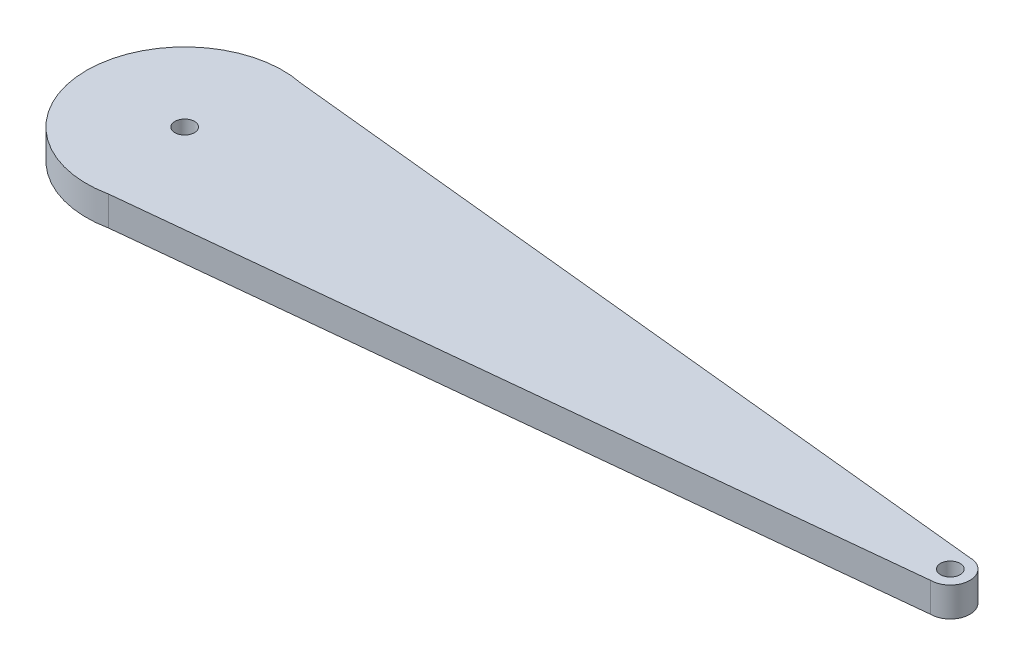
ISO-10303-21;
HEADER;
FILE_DESCRIPTION(('STEP AP214'),'2;1');
FILE_NAME('part.step','',(''),(''),'','','');
FILE_SCHEMA(('AUTOMOTIVE_DESIGN { 1 0 10303 214 1 1 1 1 }'));
ENDSEC;
DATA;
#1=APPLICATION_CONTEXT('core data for automotive mechanical design processes');
#2=APPLICATION_PROTOCOL_DEFINITION('international standard','automotive_design',2000,#1);
#3=PRODUCT_CONTEXT('',#1,'mechanical');
#4=PRODUCT('Part','Part','',(#3));
#5=PRODUCT_RELATED_PRODUCT_CATEGORY('part','',(#4));
#6=PRODUCT_DEFINITION_FORMATION('','',#4);
#7=PRODUCT_DEFINITION_CONTEXT('part definition',#1,'design');
#8=PRODUCT_DEFINITION('design','',#6,#7);
#9=PRODUCT_DEFINITION_SHAPE('','',#8);
#10=(LENGTH_UNIT() NAMED_UNIT(*) SI_UNIT(.MILLI.,.METRE.));
#11=(NAMED_UNIT(*) PLANE_ANGLE_UNIT() SI_UNIT($,.RADIAN.));
#12=(NAMED_UNIT(*) SI_UNIT($,.STERADIAN.) SOLID_ANGLE_UNIT());
#13=UNCERTAINTY_MEASURE_WITH_UNIT(LENGTH_MEASURE(1.E-05),#10,'distance_accuracy_value','');
#14=(GEOMETRIC_REPRESENTATION_CONTEXT(3) GLOBAL_UNCERTAINTY_ASSIGNED_CONTEXT((#13)) GLOBAL_UNIT_ASSIGNED_CONTEXT((#10,
#11,#12)) REPRESENTATION_CONTEXT('',''));
#15=CARTESIAN_POINT('',(0.,0.,0.));
#16=DIRECTION('',(0.,0.,1.));
#17=DIRECTION('',(1.,0.,0.));
#18=AXIS2_PLACEMENT_3D('',#15,#16,#17);
#19=CARTESIAN_POINT('',(0.,3.,0.));
#20=DIRECTION('',(0.,-1.,0.));
#21=DIRECTION('',(0.,0.,-1.));
#22=AXIS2_PLACEMENT_3D('',#19,#20,#21);
#23=PLANE('',#22);
#24=CARTESIAN_POINT('',(88.,3.,-10.));
#25=DIRECTION('',(0.,1.,0.));
#26=DIRECTION('',(0.,0.,1.));
#27=AXIS2_PLACEMENT_3D('',#24,#25,#26);
#28=CIRCLE('',#27,0.999999999999998);
#29=CARTESIAN_POINT('',(88.,3.,-9.));
#30=VERTEX_POINT('',#29);
#31=EDGE_CURVE('E136',#30,#30,#28,.T.);
#32=ORIENTED_EDGE('',*,*,#31,.F.);
#33=EDGE_LOOP('',(#32));
#34=FACE_BOUND('',#33,.T.);
#35=CARTESIAN_POINT('',(10.,3.,-10.));
#36=DIRECTION('',(0.,1.,0.));
#37=DIRECTION('',(0.,0.,1.));
#38=AXIS2_PLACEMENT_3D('',#35,#36,#37);
#39=CIRCLE('',#38,0.999999999999999);
#40=CARTESIAN_POINT('',(10.,3.,-9.));
#41=VERTEX_POINT('',#40);
#42=EDGE_CURVE('E173',#41,#41,#39,.T.);
#43=ORIENTED_EDGE('',*,*,#42,.F.);
#44=EDGE_LOOP('',(#43));
#45=FACE_BOUND('',#44,.T.);
#46=DIRECTION('',(0.994781438611053,0.,0.10202886549857));
#47=VECTOR('',#46,1.);
#48=CARTESIAN_POINT('',(2.13402732595966,3.,-20.8067664281067));
#49=LINE('',#48,#47);
#50=CARTESIAN_POINT('',(12.0299284320104,3.,-19.7918022121015));
#51=VERTEX_POINT('',#50);
#52=CARTESIAN_POINT('',(88.,3.,-12.));
#53=VERTEX_POINT('',#52);
#54=EDGE_CURVE('E117',#51,#53,#49,.T.);
#55=ORIENTED_EDGE('',*,*,#54,.F.);
#56=CARTESIAN_POINT('',(10.,3.,-10.));
#57=DIRECTION('',(0.,1.,0.));
#58=DIRECTION('',(0.,0.,1.));
#59=AXIS2_PLACEMENT_3D('',#56,#57,#58);
#60=CIRCLE('',#59,10.);
#61=CARTESIAN_POINT('',(12.0299284320104,3.,-0.208197787898494));
#62=VERTEX_POINT('',#61);
#63=EDGE_CURVE('E100',#51,#62,#60,.T.);
#64=ORIENTED_EDGE('',*,*,#63,.T.);
#65=DIRECTION('',(0.994781438611053,0.,-0.10202886549857));
#66=VECTOR('',#65,1.);
#67=CARTESIAN_POINT('',(0.104098893949252,3.,1.01496421600521));
#68=LINE('',#67,#66);
#69=CARTESIAN_POINT('',(88.,3.,-8.));
#70=VERTEX_POINT('',#69);
#71=EDGE_CURVE('E115',#62,#70,#68,.T.);
#72=ORIENTED_EDGE('',*,*,#71,.T.);
#73=CARTESIAN_POINT('',(88.,3.,-10.));
#74=DIRECTION('',(0.,1.,0.));
#75=DIRECTION('',(0.,0.,1.));
#76=AXIS2_PLACEMENT_3D('',#73,#74,#75);
#77=CIRCLE('',#76,2.);
#78=EDGE_CURVE('E109',#70,#53,#77,.T.);
#79=ORIENTED_EDGE('',*,*,#78,.T.);
#80=EDGE_LOOP('',(#55,#64,#72,#79));
#81=FACE_BOUND('',#80,.T.);
#82=ADVANCED_FACE('F63',(#34,#45,#81),#23,.F.);
#83=CARTESIAN_POINT('',(0.,0.,0.));
#84=DIRECTION('',(0.,-1.,0.));
#85=DIRECTION('',(0.,0.,-1.));
#86=AXIS2_PLACEMENT_3D('',#83,#84,#85);
#87=PLANE('',#86);
#88=CARTESIAN_POINT('',(88.,0.,-10.));
#89=DIRECTION('',(0.,1.,0.));
#90=DIRECTION('',(0.,0.,1.));
#91=AXIS2_PLACEMENT_3D('',#88,#89,#90);
#92=CIRCLE('',#91,0.999999999999998);
#93=CARTESIAN_POINT('',(88.,0.,-9.));
#94=VERTEX_POINT('',#93);
#95=EDGE_CURVE('E130',#94,#94,#92,.T.);
#96=ORIENTED_EDGE('',*,*,#95,.T.);
#97=EDGE_LOOP('',(#96));
#98=FACE_BOUND('',#97,.T.);
#99=CARTESIAN_POINT('',(10.,0.,-10.));
#100=DIRECTION('',(0.,1.,0.));
#101=DIRECTION('',(0.,0.,1.));
#102=AXIS2_PLACEMENT_3D('',#99,#100,#101);
#103=CIRCLE('',#102,0.999999999999999);
#104=CARTESIAN_POINT('',(10.,0.,-9.));
#105=VERTEX_POINT('',#104);
#106=EDGE_CURVE('E176',#105,#105,#103,.T.);
#107=ORIENTED_EDGE('',*,*,#106,.T.);
#108=EDGE_LOOP('',(#107));
#109=FACE_BOUND('',#108,.T.);
#110=CARTESIAN_POINT('',(10.,0.,-10.));
#111=DIRECTION('',(0.,1.,0.));
#112=DIRECTION('',(0.,0.,1.));
#113=AXIS2_PLACEMENT_3D('',#110,#111,#112);
#114=CIRCLE('',#113,10.);
#115=CARTESIAN_POINT('',(12.0299284320104,0.,-19.7918022121015));
#116=VERTEX_POINT('',#115);
#117=CARTESIAN_POINT('',(12.0299284320104,0.,-0.208197787898494));
#118=VERTEX_POINT('',#117);
#119=EDGE_CURVE('E79',#116,#118,#114,.T.);
#120=ORIENTED_EDGE('',*,*,#119,.F.);
#121=DIRECTION('',(0.994781438611053,0.,0.10202886549857));
#122=VECTOR('',#121,1.);
#123=CARTESIAN_POINT('',(2.13402732595966,0.,-20.8067664281067));
#124=LINE('',#123,#122);
#125=CARTESIAN_POINT('',(88.,0.,-12.));
#126=VERTEX_POINT('',#125);
#127=EDGE_CURVE('E146',#116,#126,#124,.T.);
#128=ORIENTED_EDGE('',*,*,#127,.T.);
#129=CARTESIAN_POINT('',(88.,0.,-10.));
#130=DIRECTION('',(0.,1.,0.));
#131=DIRECTION('',(0.,0.,1.));
#132=AXIS2_PLACEMENT_3D('',#129,#130,#131);
#133=CIRCLE('',#132,2.);
#134=CARTESIAN_POINT('',(88.,0.,-8.));
#135=VERTEX_POINT('',#134);
#136=EDGE_CURVE('E87',#135,#126,#133,.T.);
#137=ORIENTED_EDGE('',*,*,#136,.F.);
#138=DIRECTION('',(0.994781438611053,0.,-0.10202886549857));
#139=VECTOR('',#138,1.);
#140=CARTESIAN_POINT('',(0.104098893949252,0.,1.01496421600521));
#141=LINE('',#140,#139);
#142=EDGE_CURVE('E129',#118,#135,#141,.T.);
#143=ORIENTED_EDGE('',*,*,#142,.F.);
#144=EDGE_LOOP('',(#120,#128,#137,#143));
#145=FACE_BOUND('',#144,.T.);
#146=ADVANCED_FACE('F65',(#98,#109,#145),#87,.T.);
#147=CARTESIAN_POINT('',(88.,0.,-10.));
#148=DIRECTION('',(0.,1.,0.));
#149=DIRECTION('',(0.,0.,1.));
#150=AXIS2_PLACEMENT_3D('',#147,#148,#149);
#151=CYLINDRICAL_SURFACE('',#150,2.);
#152=ORIENTED_EDGE('',*,*,#78,.F.);
#153=DIRECTION('',(0.,1.,0.));
#154=VECTOR('',#153,1.);
#155=CARTESIAN_POINT('',(88.,0.,-8.));
#156=LINE('',#155,#154);
#157=EDGE_CURVE('E125',#135,#70,#156,.T.);
#158=ORIENTED_EDGE('',*,*,#157,.F.);
#159=ORIENTED_EDGE('',*,*,#136,.T.);
#160=DIRECTION('',(0.,1.,0.));
#161=VECTOR('',#160,1.);
#162=CARTESIAN_POINT('',(88.,0.,-12.));
#163=LINE('',#162,#161);
#164=EDGE_CURVE('E12',#126,#53,#163,.T.);
#165=ORIENTED_EDGE('',*,*,#164,.T.);
#166=EDGE_LOOP('',(#152,#158,#159,#165));
#167=FACE_BOUND('',#166,.T.);
#168=ADVANCED_FACE('F155',(#167),#151,.T.);
#169=CARTESIAN_POINT('',(2.13402732595966,0.,-20.8067664281067));
#170=DIRECTION('',(-0.10202886549857,0.,0.994781438611052));
#171=DIRECTION('',(0.994781438611053,0.,0.10202886549857));
#172=AXIS2_PLACEMENT_3D('',#169,#170,#171);
#173=PLANE('',#172);
#174=ORIENTED_EDGE('',*,*,#54,.T.);
#175=ORIENTED_EDGE('',*,*,#164,.F.);
#176=ORIENTED_EDGE('',*,*,#127,.F.);
#177=DIRECTION('',(0.,1.,0.));
#178=VECTOR('',#177,1.);
#179=CARTESIAN_POINT('',(12.0299284320104,0.,-19.7918022121015));
#180=LINE('',#179,#178);
#181=EDGE_CURVE('E67',#116,#51,#180,.T.);
#182=ORIENTED_EDGE('',*,*,#181,.T.);
#183=EDGE_LOOP('',(#174,#175,#176,#182));
#184=FACE_BOUND('',#183,.T.);
#185=ADVANCED_FACE('F153',(#184),#173,.F.);
#186=CARTESIAN_POINT('',(10.,0.,-10.));
#187=DIRECTION('',(0.,1.,0.));
#188=DIRECTION('',(0.,0.,1.));
#189=AXIS2_PLACEMENT_3D('',#186,#187,#188);
#190=CYLINDRICAL_SURFACE('',#189,10.);
#191=ORIENTED_EDGE('',*,*,#63,.F.);
#192=ORIENTED_EDGE('',*,*,#181,.F.);
#193=ORIENTED_EDGE('',*,*,#119,.T.);
#194=DIRECTION('',(0.,1.,0.));
#195=VECTOR('',#194,1.);
#196=CARTESIAN_POINT('',(12.0299284320104,0.,-0.208197787898494));
#197=LINE('',#196,#195);
#198=EDGE_CURVE('E119',#118,#62,#197,.T.);
#199=ORIENTED_EDGE('',*,*,#198,.T.);
#200=EDGE_LOOP('',(#191,#192,#193,#199));
#201=FACE_BOUND('',#200,.T.);
#202=ADVANCED_FACE('F121',(#201),#190,.T.);
#203=CARTESIAN_POINT('',(0.104098893949252,0.,1.01496421600521));
#204=DIRECTION('',(0.10202886549857,0.,0.994781438611052));
#205=DIRECTION('',(0.994781438611053,0.,-0.10202886549857));
#206=AXIS2_PLACEMENT_3D('',#203,#204,#205);
#207=PLANE('',#206);
#208=ORIENTED_EDGE('',*,*,#71,.F.);
#209=ORIENTED_EDGE('',*,*,#198,.F.);
#210=ORIENTED_EDGE('',*,*,#142,.T.);
#211=ORIENTED_EDGE('',*,*,#157,.T.);
#212=EDGE_LOOP('',(#208,#209,#210,#211));
#213=FACE_BOUND('',#212,.T.);
#214=ADVANCED_FACE('F127',(#213),#207,.T.);
#215=CARTESIAN_POINT('',(10.,0.,-10.));
#216=DIRECTION('',(0.,1.,0.));
#217=DIRECTION('',(0.,0.,1.));
#218=AXIS2_PLACEMENT_3D('',#215,#216,#217);
#219=CYLINDRICAL_SURFACE('',#218,0.999999999999999);
#220=ORIENTED_EDGE('',*,*,#106,.F.);
#221=EDGE_LOOP('',(#220));
#222=FACE_BOUND('',#221,.T.);
#223=ORIENTED_EDGE('',*,*,#42,.T.);
#224=EDGE_LOOP('',(#223));
#225=FACE_BOUND('',#224,.T.);
#226=ADVANCED_FACE('F185',(#222,#225),#219,.F.);
#227=CARTESIAN_POINT('',(88.,0.,-10.));
#228=DIRECTION('',(0.,1.,0.));
#229=DIRECTION('',(0.,0.,1.));
#230=AXIS2_PLACEMENT_3D('',#227,#228,#229);
#231=CYLINDRICAL_SURFACE('',#230,0.999999999999998);
#232=ORIENTED_EDGE('',*,*,#95,.F.);
#233=EDGE_LOOP('',(#232));
#234=FACE_BOUND('',#233,.T.);
#235=ORIENTED_EDGE('',*,*,#31,.T.);
#236=EDGE_LOOP('',(#235));
#237=FACE_BOUND('',#236,.T.);
#238=ADVANCED_FACE('F183',(#234,#237),#231,.F.);
#239=CLOSED_SHELL('',(#82,#146,#168,#185,#202,#214,#226,#238));
#240=MANIFOLD_SOLID_BREP('B2',#239);
#241=ADVANCED_BREP_SHAPE_REPRESENTATION('',(#18,#240),#14);
#242=SHAPE_DEFINITION_REPRESENTATION(#9,#241);
ENDSEC;
END-ISO-10303-21;
